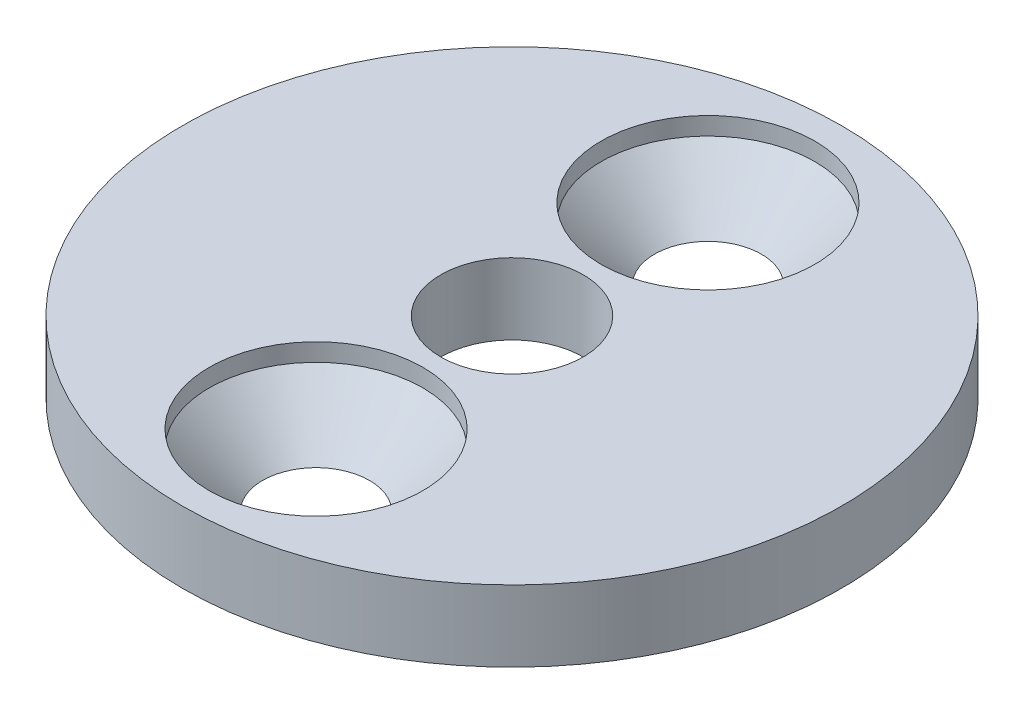
ISO-10303-21;
HEADER;
FILE_DESCRIPTION(('STEP AP214'),'2;1');
FILE_NAME('part.step','',(''),(''),'','','');
FILE_SCHEMA(('AUTOMOTIVE_DESIGN { 1 0 10303 214 1 1 1 1 }'));
ENDSEC;
DATA;
#1=APPLICATION_CONTEXT('core data for automotive mechanical design processes');
#2=APPLICATION_PROTOCOL_DEFINITION('international standard','automotive_design',2000,#1);
#3=PRODUCT_CONTEXT('',#1,'mechanical');
#4=PRODUCT('Part','Part','',(#3));
#5=PRODUCT_RELATED_PRODUCT_CATEGORY('part','',(#4));
#6=PRODUCT_DEFINITION_FORMATION('','',#4);
#7=PRODUCT_DEFINITION_CONTEXT('part definition',#1,'design');
#8=PRODUCT_DEFINITION('design','',#6,#7);
#9=PRODUCT_DEFINITION_SHAPE('','',#8);
#10=(LENGTH_UNIT() NAMED_UNIT(*) SI_UNIT(.MILLI.,.METRE.));
#11=(NAMED_UNIT(*) PLANE_ANGLE_UNIT() SI_UNIT($,.RADIAN.));
#12=(NAMED_UNIT(*) SI_UNIT($,.STERADIAN.) SOLID_ANGLE_UNIT());
#13=UNCERTAINTY_MEASURE_WITH_UNIT(LENGTH_MEASURE(1.E-05),#10,'distance_accuracy_value','');
#14=(GEOMETRIC_REPRESENTATION_CONTEXT(3) GLOBAL_UNCERTAINTY_ASSIGNED_CONTEXT((#13)) GLOBAL_UNIT_ASSIGNED_CONTEXT((#10,
#11,#12)) REPRESENTATION_CONTEXT('',''));
#15=CARTESIAN_POINT('',(0.,0.,0.));
#16=DIRECTION('',(0.,0.,1.));
#17=DIRECTION('',(1.,0.,0.));
#18=AXIS2_PLACEMENT_3D('',#15,#16,#17);
#19=CARTESIAN_POINT('',(0.,2.,0.));
#20=DIRECTION('',(0.,1.,0.));
#21=DIRECTION('',(0.,0.,1.));
#22=AXIS2_PLACEMENT_3D('',#19,#20,#21);
#23=PLANE('',#22);
#24=CARTESIAN_POINT('',(0.,2.,5.5));
#25=DIRECTION('',(0.,1.,0.));
#26=DIRECTION('',(0.,0.,-1.));
#27=AXIS2_PLACEMENT_3D('',#24,#25,#26);
#28=CIRCLE('',#27,3.);
#29=CARTESIAN_POINT('',(0.,2.,2.5));
#30=VERTEX_POINT('',#29);
#31=EDGE_CURVE('E57',#30,#30,#28,.T.);
#32=ORIENTED_EDGE('',*,*,#31,.F.);
#33=EDGE_LOOP('',(#32));
#34=FACE_BOUND('',#33,.T.);
#35=CARTESIAN_POINT('',(0.,2.,-5.5));
#36=DIRECTION('',(0.,1.,0.));
#37=DIRECTION('',(0.,0.,1.));
#38=AXIS2_PLACEMENT_3D('',#35,#36,#37);
#39=CIRCLE('',#38,3.);
#40=CARTESIAN_POINT('',(0.,2.,-2.5));
#41=VERTEX_POINT('',#40);
#42=EDGE_CURVE('E46',#41,#41,#39,.T.);
#43=ORIENTED_EDGE('',*,*,#42,.F.);
#44=EDGE_LOOP('',(#43));
#45=FACE_BOUND('',#44,.T.);
#46=CARTESIAN_POINT('',(0.,2.,0.));
#47=DIRECTION('',(0.,1.,0.));
#48=DIRECTION('',(0.,0.,1.));
#49=AXIS2_PLACEMENT_3D('',#46,#47,#48);
#50=CIRCLE('',#49,9.25);
#51=CARTESIAN_POINT('',(0.,2.,9.25));
#52=VERTEX_POINT('',#51);
#53=EDGE_CURVE('E10',#52,#52,#50,.T.);
#54=ORIENTED_EDGE('',*,*,#53,.T.);
#55=EDGE_LOOP('',(#54));
#56=FACE_BOUND('',#55,.T.);
#57=CARTESIAN_POINT('',(0.,2.,0.));
#58=DIRECTION('',(0.,1.,0.));
#59=DIRECTION('',(0.,0.,1.));
#60=AXIS2_PLACEMENT_3D('',#57,#58,#59);
#61=CIRCLE('',#60,2.);
#62=CARTESIAN_POINT('',(0.,2.,2.));
#63=VERTEX_POINT('',#62);
#64=EDGE_CURVE('E41',#63,#63,#61,.T.);
#65=ORIENTED_EDGE('',*,*,#64,.F.);
#66=EDGE_LOOP('',(#65));
#67=FACE_BOUND('',#66,.T.);
#68=ADVANCED_FACE('F30',(#34,#45,#56,#67),#23,.T.);
#69=CARTESIAN_POINT('',(0.,0.,0.));
#70=DIRECTION('',(0.,1.,0.));
#71=DIRECTION('',(0.,0.,1.));
#72=AXIS2_PLACEMENT_3D('',#69,#70,#71);
#73=PLANE('',#72);
#74=CARTESIAN_POINT('',(0.,0.,5.5));
#75=DIRECTION('',(0.,1.,0.));
#76=DIRECTION('',(0.,0.,-1.));
#77=AXIS2_PLACEMENT_3D('',#74,#75,#76);
#78=CIRCLE('',#77,1.5);
#79=CARTESIAN_POINT('',(0.,0.,4.));
#80=VERTEX_POINT('',#79);
#81=EDGE_CURVE('E63',#80,#80,#78,.T.);
#82=ORIENTED_EDGE('',*,*,#81,.T.);
#83=EDGE_LOOP('',(#82));
#84=FACE_BOUND('',#83,.T.);
#85=CARTESIAN_POINT('',(0.,0.,-5.5));
#86=DIRECTION('',(0.,1.,0.));
#87=DIRECTION('',(0.,0.,1.));
#88=AXIS2_PLACEMENT_3D('',#85,#86,#87);
#89=CIRCLE('',#88,1.5);
#90=CARTESIAN_POINT('',(0.,0.,-4.));
#91=VERTEX_POINT('',#90);
#92=EDGE_CURVE('E54',#91,#91,#89,.T.);
#93=ORIENTED_EDGE('',*,*,#92,.T.);
#94=EDGE_LOOP('',(#93));
#95=FACE_BOUND('',#94,.T.);
#96=CARTESIAN_POINT('',(0.,0.,0.));
#97=DIRECTION('',(0.,1.,0.));
#98=DIRECTION('',(0.,0.,1.));
#99=AXIS2_PLACEMENT_3D('',#96,#97,#98);
#100=CIRCLE('',#99,9.25);
#101=CARTESIAN_POINT('',(0.,0.,9.25));
#102=VERTEX_POINT('',#101);
#103=EDGE_CURVE('E34',#102,#102,#100,.T.);
#104=ORIENTED_EDGE('',*,*,#103,.F.);
#105=EDGE_LOOP('',(#104));
#106=FACE_BOUND('',#105,.T.);
#107=CARTESIAN_POINT('',(0.,0.,0.));
#108=DIRECTION('',(0.,1.,0.));
#109=DIRECTION('',(0.,0.,1.));
#110=AXIS2_PLACEMENT_3D('',#107,#108,#109);
#111=CIRCLE('',#110,2.);
#112=CARTESIAN_POINT('',(0.,0.,2.));
#113=VERTEX_POINT('',#112);
#114=EDGE_CURVE('E43',#113,#113,#111,.T.);
#115=ORIENTED_EDGE('',*,*,#114,.T.);
#116=EDGE_LOOP('',(#115));
#117=FACE_BOUND('',#116,.T.);
#118=ADVANCED_FACE('F67',(#84,#95,#106,#117),#73,.F.);
#119=CARTESIAN_POINT('',(0.,2.,0.));
#120=DIRECTION('',(0.,-1.,0.));
#121=DIRECTION('',(0.,0.,-1.));
#122=AXIS2_PLACEMENT_3D('',#119,#120,#121);
#123=CYLINDRICAL_SURFACE('',#122,9.25);
#124=ORIENTED_EDGE('',*,*,#53,.F.);
#125=EDGE_LOOP('',(#124));
#126=FACE_BOUND('',#125,.T.);
#127=ORIENTED_EDGE('',*,*,#103,.T.);
#128=EDGE_LOOP('',(#127));
#129=FACE_BOUND('',#128,.T.);
#130=ADVANCED_FACE('F32',(#126,#129),#123,.T.);
#131=CARTESIAN_POINT('',(0.,2.,0.));
#132=DIRECTION('',(0.,-1.,0.));
#133=DIRECTION('',(0.,0.,-1.));
#134=AXIS2_PLACEMENT_3D('',#131,#132,#133);
#135=CYLINDRICAL_SURFACE('',#134,2.);
#136=ORIENTED_EDGE('',*,*,#64,.T.);
#137=EDGE_LOOP('',(#136));
#138=FACE_BOUND('',#137,.T.);
#139=ORIENTED_EDGE('',*,*,#114,.F.);
#140=EDGE_LOOP('',(#139));
#141=FACE_BOUND('',#140,.T.);
#142=ADVANCED_FACE('F90',(#138,#141),#135,.F.);
#143=CARTESIAN_POINT('',(0.,2.,-5.5));
#144=DIRECTION('',(0.,1.,0.));
#145=DIRECTION('',(0.,0.,1.));
#146=AXIS2_PLACEMENT_3D('',#143,#144,#145);
#147=CYLINDRICAL_SURFACE('',#146,3.);
#148=ORIENTED_EDGE('',*,*,#42,.T.);
#149=EDGE_LOOP('',(#148));
#150=FACE_BOUND('',#149,.T.);
#151=CARTESIAN_POINT('',(0.,1.50000000000001,-5.5));
#152=DIRECTION('',(0.,1.,0.));
#153=DIRECTION('',(0.,0.,1.));
#154=AXIS2_PLACEMENT_3D('',#151,#152,#153);
#155=CIRCLE('',#154,3.);
#156=CARTESIAN_POINT('',(0.,1.50000000000001,-2.5));
#157=VERTEX_POINT('',#156);
#158=EDGE_CURVE('E51',#157,#157,#155,.T.);
#159=ORIENTED_EDGE('',*,*,#158,.F.);
#160=EDGE_LOOP('',(#159));
#161=FACE_BOUND('',#160,.T.);
#162=ADVANCED_FACE('F93',(#150,#161),#147,.F.);
#163=CARTESIAN_POINT('',(0.,0.,-5.5));
#164=DIRECTION('',(0.,1.,0.));
#165=DIRECTION('',(0.,0.,1.));
#166=AXIS2_PLACEMENT_3D('',#163,#164,#165);
#167=CONICAL_SURFACE('',#166,1.5,0.785398163397446);
#168=ORIENTED_EDGE('',*,*,#158,.T.);
#169=EDGE_LOOP('',(#168));
#170=FACE_BOUND('',#169,.T.);
#171=ORIENTED_EDGE('',*,*,#92,.F.);
#172=EDGE_LOOP('',(#171));
#173=FACE_BOUND('',#172,.T.);
#174=ADVANCED_FACE('F78',(#170,#173),#167,.F.);
#175=CARTESIAN_POINT('',(0.,2.,5.5));
#176=DIRECTION('',(0.,1.,0.));
#177=DIRECTION('',(0.,0.,-1.));
#178=AXIS2_PLACEMENT_3D('',#175,#176,#177);
#179=CYLINDRICAL_SURFACE('',#178,3.);
#180=ORIENTED_EDGE('',*,*,#31,.T.);
#181=EDGE_LOOP('',(#180));
#182=FACE_BOUND('',#181,.T.);
#183=CARTESIAN_POINT('',(0.,1.50000000000001,5.5));
#184=DIRECTION('',(0.,1.,0.));
#185=DIRECTION('',(0.,0.,-1.));
#186=AXIS2_PLACEMENT_3D('',#183,#184,#185);
#187=CIRCLE('',#186,3.);
#188=CARTESIAN_POINT('',(0.,1.50000000000001,2.5));
#189=VERTEX_POINT('',#188);
#190=EDGE_CURVE('E60',#189,#189,#187,.T.);
#191=ORIENTED_EDGE('',*,*,#190,.F.);
#192=EDGE_LOOP('',(#191));
#193=FACE_BOUND('',#192,.T.);
#194=ADVANCED_FACE('F72',(#182,#193),#179,.F.);
#195=CARTESIAN_POINT('',(0.,0.,5.5));
#196=DIRECTION('',(0.,1.,0.));
#197=DIRECTION('',(0.,0.,-1.));
#198=AXIS2_PLACEMENT_3D('',#195,#196,#197);
#199=CONICAL_SURFACE('',#198,1.5,0.785398163397446);
#200=ORIENTED_EDGE('',*,*,#190,.T.);
#201=EDGE_LOOP('',(#200));
#202=FACE_BOUND('',#201,.T.);
#203=ORIENTED_EDGE('',*,*,#81,.F.);
#204=EDGE_LOOP('',(#203));
#205=FACE_BOUND('',#204,.T.);
#206=ADVANCED_FACE('F70',(#202,#205),#199,.F.);
#207=CLOSED_SHELL('',(#68,#118,#130,#142,#162,#174,#194,#206));
#208=MANIFOLD_SOLID_BREP('B2',#207);
#209=ADVANCED_BREP_SHAPE_REPRESENTATION('',(#18,#208),#14);
#210=SHAPE_DEFINITION_REPRESENTATION(#9,#209);
ENDSEC;
END-ISO-10303-21;
